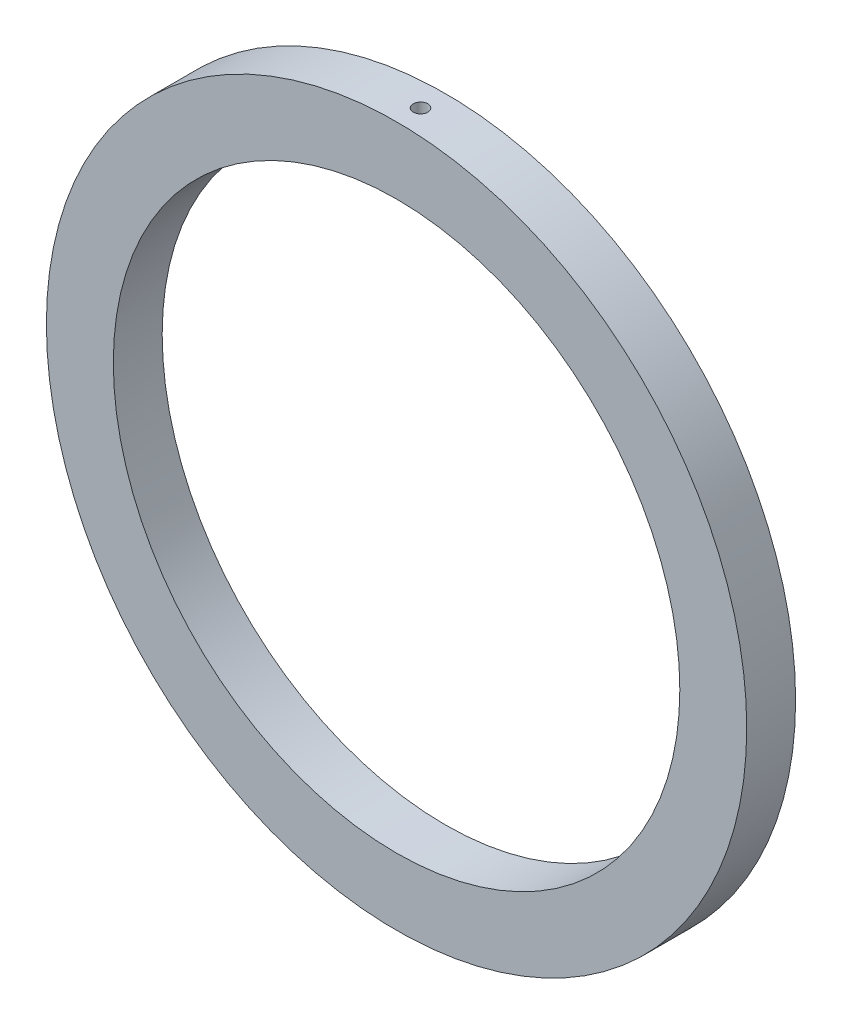
ISO-10303-21;
HEADER;
FILE_DESCRIPTION(('STEP AP214'),'2;1');
FILE_NAME('part.step','',(''),(''),'','','');
FILE_SCHEMA(('AUTOMOTIVE_DESIGN { 1 0 10303 214 1 1 1 1 }'));
ENDSEC;
DATA;
#1=APPLICATION_CONTEXT('core data for automotive mechanical design processes');
#2=APPLICATION_PROTOCOL_DEFINITION('international standard','automotive_design',2000,#1);
#3=PRODUCT_CONTEXT('',#1,'mechanical');
#4=PRODUCT('Part','Part','',(#3));
#5=PRODUCT_RELATED_PRODUCT_CATEGORY('part','',(#4));
#6=PRODUCT_DEFINITION_FORMATION('','',#4);
#7=PRODUCT_DEFINITION_CONTEXT('part definition',#1,'design');
#8=PRODUCT_DEFINITION('design','',#6,#7);
#9=PRODUCT_DEFINITION_SHAPE('','',#8);
#10=(LENGTH_UNIT() NAMED_UNIT(*) SI_UNIT(.MILLI.,.METRE.));
#11=(NAMED_UNIT(*) PLANE_ANGLE_UNIT() SI_UNIT($,.RADIAN.));
#12=(NAMED_UNIT(*) SI_UNIT($,.STERADIAN.) SOLID_ANGLE_UNIT());
#13=UNCERTAINTY_MEASURE_WITH_UNIT(LENGTH_MEASURE(1.E-05),#10,'distance_accuracy_value','');
#14=(GEOMETRIC_REPRESENTATION_CONTEXT(3) GLOBAL_UNCERTAINTY_ASSIGNED_CONTEXT((#13)) GLOBAL_UNIT_ASSIGNED_CONTEXT((#10,
#11,#12)) REPRESENTATION_CONTEXT('',''));
#15=CARTESIAN_POINT('',(0.,0.,0.));
#16=DIRECTION('',(0.,0.,1.));
#17=DIRECTION('',(1.,0.,0.));
#18=AXIS2_PLACEMENT_3D('',#15,#16,#17);
#19=CARTESIAN_POINT('',(0.,0.,-1.9939));
#20=DIRECTION('',(0.,0.,1.));
#21=DIRECTION('',(1.,0.,0.));
#22=AXIS2_PLACEMENT_3D('',#19,#20,#21);
#23=CYLINDRICAL_SURFACE('',#22,28.575);
#24=CARTESIAN_POINT('',(0.,28.575,0.637578096554717));
#25=CARTESIAN_POINT('',(0.0334528999908487,28.5749999161991,0.637576614259042));
#26=CARTESIAN_POINT('',(0.0669299639904624,28.5749406242775,0.63475037074814));
#27=CARTESIAN_POINT('',(0.132961848801411,28.5747097969714,0.623515293730455));
#28=CARTESIAN_POINT('',(0.165515514746734,28.5745381269837,0.615099765367812));
#29=CARTESIAN_POINT('',(0.228734428833565,28.574101987914,0.592926033408662));
#30=CARTESIAN_POINT('',(0.259400581216334,28.5738375636805,0.579170411509186));
#31=CARTESIAN_POINT('',(0.317979756216489,28.5732457559899,0.54671058644263));
#32=CARTESIAN_POINT('',(0.345893455054542,28.5729183880554,0.528007602918667));
#33=CARTESIAN_POINT('',(0.398192242681697,28.5722374562947,0.486177180929941));
#34=CARTESIAN_POINT('',(0.422576481922313,28.5718838861924,0.463048680334133));
#35=CARTESIAN_POINT('',(0.467117124456493,28.5711904560958,0.413025317546382));
#36=CARTESIAN_POINT('',(0.487273360590718,28.570850596644,0.386130306510862));
#37=CARTESIAN_POINT('',(0.522786087063194,28.5702228961807,0.329335597564676));
#38=CARTESIAN_POINT('',(0.538142229739271,28.5699350589377,0.299435682221337));
#39=CARTESIAN_POINT('',(0.563616533922403,28.5694438983801,0.237481497482183));
#40=CARTESIAN_POINT('',(0.57373471101576,28.569240574814,0.205427234497251));
#41=CARTESIAN_POINT('',(0.588444484796919,28.5689414011349,0.140079173328698));
#42=CARTESIAN_POINT('',(0.593036884815562,28.5688455354001,0.106785556046629));
#43=CARTESIAN_POINT('',(0.596567211636588,28.5687720391495,0.0398998184894518));
#44=CARTESIAN_POINT('',(0.59550515460464,28.5687944082958,0.00630769906801369));
#45=CARTESIAN_POINT('',(0.587757411822672,28.5689548447067,-0.0602160288091746));
#46=CARTESIAN_POINT('',(0.581072598895781,28.5690928940144,-0.0931477389682907));
#47=CARTESIAN_POINT('',(0.562270448749933,28.569469099415,-0.157421406933881));
#48=CARTESIAN_POINT('',(0.550153102787935,28.5697072556691,-0.188763362181737));
#49=CARTESIAN_POINT('',(0.520828855441891,28.5702568469183,-0.24897061327009));
#50=CARTESIAN_POINT('',(0.503621553703102,28.5705682876774,-0.277835714061033));
#51=CARTESIAN_POINT('',(0.464606155929852,28.5712293310835,-0.332267725321397));
#52=CARTESIAN_POINT('',(0.442798055781932,28.5715789337647,-0.357834632841954));
#53=CARTESIAN_POINT('',(0.395195170796264,28.5722769682631,-0.40494959773213));
#54=CARTESIAN_POINT('',(0.36939962771116,28.5726253998447,-0.426496889012981));
#55=CARTESIAN_POINT('',(0.314556783589352,28.5732817469318,-0.464955068560625));
#56=CARTESIAN_POINT('',(0.285509482082942,28.5735896624314,-0.481865956157703));
#57=CARTESIAN_POINT('',(0.224987262369017,28.5741302664852,-0.510571191990976));
#58=CARTESIAN_POINT('',(0.193512333151503,28.5743629546981,-0.522365517020465));
#59=CARTESIAN_POINT('',(0.129028518783557,28.5747268665664,-0.540502339896482));
#60=CARTESIAN_POINT('',(0.0960196356843895,28.5748580903574,-0.546844845033184));
#61=CARTESIAN_POINT('',(0.0294115841189962,28.5750042630136,-0.553897048674563));
#62=CARTESIAN_POINT('',(-0.00418747209922792,28.5750192337546,-0.554607806928717));
#63=CARTESIAN_POINT('',(-0.0710279466882617,28.5749312705178,-0.550379101186067));
#64=CARTESIAN_POINT('',(-0.104269365250668,28.5748283366032,-0.545439640216407));
#65=CARTESIAN_POINT('',(-0.169447998357077,28.5745161811143,-0.530051587887457));
#66=CARTESIAN_POINT('',(-0.20138532633598,28.5743069688059,-0.5196034767967));
#67=CARTESIAN_POINT('',(-0.263052658950643,28.5738058378134,-0.493495200374856));
#68=CARTESIAN_POINT('',(-0.292782661589836,28.5735139190544,-0.477835030329431));
#69=CARTESIAN_POINT('',(-0.349196287514604,28.572880219415,-0.441744444692552));
#70=CARTESIAN_POINT('',(-0.375879454111067,28.5725384310772,-0.421313315377685));
#71=CARTESIAN_POINT('',(-0.425437380694861,28.5718435441532,-0.376261828458401));
#72=CARTESIAN_POINT('',(-0.448312135193495,28.5714904455508,-0.351641464816549));
#73=CARTESIAN_POINT('',(-0.489607425323709,28.5708126835533,-0.298905863132508));
#74=CARTESIAN_POINT('',(-0.508027276993644,28.5704880245295,-0.270790089441663));
#75=CARTESIAN_POINT('',(-0.539885197918953,28.5699038138735,-0.211864538225366));
#76=CARTESIAN_POINT('',(-0.553323275318891,28.5696442621349,-0.181054765104359));
#77=CARTESIAN_POINT('',(-0.574834997785161,28.5692195602294,-0.117618379860635));
#78=CARTESIAN_POINT('',(-0.582909087833757,28.5690544022321,-0.084991918689007));
#79=CARTESIAN_POINT('',(-0.593465103780745,28.5688370863681,-0.0188461389478242));
#80=CARTESIAN_POINT('',(-0.595947026834988,28.5687849285589,0.0146731800758243));
#81=CARTESIAN_POINT('',(-0.595248192421256,28.5687994966654,0.0816462678878778));
#82=CARTESIAN_POINT('',(-0.592068518280755,28.5688661998374,0.115100047990754));
#83=CARTESIAN_POINT('',(-0.58013896595761,28.5691109223478,0.18099888189537));
#84=CARTESIAN_POINT('',(-0.571389076643459,28.5692889419086,0.213443933681132));
#85=CARTESIAN_POINT('',(-0.54856751438054,28.5697362268339,0.276404992911517));
#86=CARTESIAN_POINT('',(-0.534495745658243,28.5700054938403,0.306920965628539));
#87=CARTESIAN_POINT('',(-0.501430556537403,28.5706049045306,0.36515639346809));
#88=CARTESIAN_POINT('',(-0.482437322009913,28.5709350459152,0.392875954148961));
#89=CARTESIAN_POINT('',(-0.440066352783966,28.5716190356953,0.444735939745629));
#90=CARTESIAN_POINT('',(-0.416688245778047,28.5719728861023,0.468876060429152));
#91=CARTESIAN_POINT('',(-0.366204293031286,28.5726644762261,0.512895213220377));
#92=CARTESIAN_POINT('',(-0.339097523897462,28.5730022119242,0.53277318668908));
#93=CARTESIAN_POINT('',(-0.281918161074939,28.5736235810191,0.56770547112011));
#94=CARTESIAN_POINT('',(-0.251843916131714,28.5739071840332,0.582757076424397));
#95=CARTESIAN_POINT('',(-0.189618119027895,28.5743877273754,0.60758010635843));
#96=CARTESIAN_POINT('',(-0.157469102641933,28.5745847712783,0.617357844796473));
#97=CARTESIAN_POINT('',(-0.104263388774644,28.5748171731576,0.628756739634627));
#98=CARTESIAN_POINT('',(-0.0835522339716464,28.5748854368502,0.632060603674147));
#99=CARTESIAN_POINT('',(-0.041897212756486,28.5749768765127,0.636471746200562));
#100=CARTESIAN_POINT('',(-0.0209533463770151,28.575000052489,0.637579024996039));
#101=CARTESIAN_POINT('',(0.,28.575,0.637578096554717));
#102=B_SPLINE_CURVE_WITH_KNOTS('',3,(#24,#25,#26,#27,#28,#29,#30,#31,#32,#33,#34,#35,#36,#37,
#38,#39,#40,#41,#42,#43,#44,#45,#46,#47,#48,#49,#50,#51,#52,#53,#54,#55,#56,#57,#58,#59,#60,#61,
#62,#63,#64,#65,#66,#67,#68,#69,#70,#71,#72,#73,#74,#75,#76,#77,#78,#79,#80,#81,#82,#83,#84,#85,
#86,#87,#88,#89,#90,#91,#92,#93,#94,#95,#96,#97,#98,#99,#100,#101),.UNSPECIFIED.,.T.,.F.,(4,2,2,
2,2,2,2,2,2,2,2,2,2,2,2,2,2,2,2,2,2,2,2,2,2,2,2,2,2,2,2,2,2,2,2,2,2,2,4),(0.,0.100282218977829,
0.20068477333894,0.301038847871405,0.401368205740381,0.50172167308372,0.602079107278149,
0.702443808498554,0.802808211068008,0.903158021017436,1.00350754407442,1.10384149270037,
1.20417560280289,1.30451760686848,1.40485970064771,1.50522089888521,1.6055821116196,
1.70594377954805,1.80630531327267,1.90664796109713,2.00699055516234,2.10732440236174,
2.20765834031392,2.30800729759555,2.40835639949919,2.50872089824345,2.60908523290384,
2.70944124056332,2.80979729926334,2.91013415723452,3.01047121571933,3.1108100799744,
3.21114515524191,3.31148875354441,3.41185724655385,3.51228190808494,3.61258607408226,
3.67539821788629,3.73821035286631),.UNSPECIFIED.);
#103=CARTESIAN_POINT('',(0.,28.575,0.637578096554717));
#104=VERTEX_POINT('',#103);
#105=EDGE_CURVE('E11',#104,#104,#102,.T.);
#106=ORIENTED_EDGE('',*,*,#105,.F.);
#107=EDGE_LOOP('',(#106));
#108=FACE_BOUND('',#107,.T.);
#109=CARTESIAN_POINT('',(0.,0.,-1.9939));
#110=DIRECTION('',(0.,0.,1.));
#111=DIRECTION('',(1.,0.,0.));
#112=AXIS2_PLACEMENT_3D('',#109,#110,#111);
#113=CIRCLE('',#112,28.575);
#114=CARTESIAN_POINT('',(28.575,0.,-1.9939));
#115=VERTEX_POINT('',#114);
#116=EDGE_CURVE('E47',#115,#115,#113,.T.);
#117=ORIENTED_EDGE('',*,*,#116,.T.);
#118=EDGE_LOOP('',(#117));
#119=FACE_BOUND('',#118,.T.);
#120=CARTESIAN_POINT('',(0.,0.,1.9939));
#121=DIRECTION('',(0.,0.,1.));
#122=DIRECTION('',(1.,0.,0.));
#123=AXIS2_PLACEMENT_3D('',#120,#121,#122);
#124=CIRCLE('',#123,28.575);
#125=CARTESIAN_POINT('',(28.575,0.,1.9939));
#126=VERTEX_POINT('',#125);
#127=EDGE_CURVE('E63',#126,#126,#124,.T.);
#128=ORIENTED_EDGE('',*,*,#127,.F.);
#129=EDGE_LOOP('',(#128));
#130=FACE_BOUND('',#129,.T.);
#131=ADVANCED_FACE('F37',(#108,#119,#130),#23,.T.);
#132=CARTESIAN_POINT('',(0.,0.,-1.9939));
#133=DIRECTION('',(0.,0.,1.));
#134=DIRECTION('',(1.,0.,0.));
#135=AXIS2_PLACEMENT_3D('',#132,#133,#134);
#136=PLANE('',#135);
#137=CARTESIAN_POINT('',(0.,0.,-1.9939));
#138=DIRECTION('',(0.,0.,1.));
#139=DIRECTION('',(1.,0.,0.));
#140=AXIS2_PLACEMENT_3D('',#137,#138,#139);
#141=CIRCLE('',#140,23.114);
#142=CARTESIAN_POINT('',(23.114,0.,-1.9939));
#143=VERTEX_POINT('',#142);
#144=EDGE_CURVE('E68',#143,#143,#141,.T.);
#145=ORIENTED_EDGE('',*,*,#144,.T.);
#146=EDGE_LOOP('',(#145));
#147=FACE_BOUND('',#146,.T.);
#148=ORIENTED_EDGE('',*,*,#116,.F.);
#149=EDGE_LOOP('',(#148));
#150=FACE_BOUND('',#149,.T.);
#151=ADVANCED_FACE('F75',(#147,#150),#136,.F.);
#152=CARTESIAN_POINT('',(0.,0.,-1.9939));
#153=DIRECTION('',(0.,0.,1.));
#154=DIRECTION('',(1.,0.,0.));
#155=AXIS2_PLACEMENT_3D('',#152,#153,#154);
#156=CYLINDRICAL_SURFACE('',#155,23.114);
#157=ORIENTED_EDGE('',*,*,#144,.F.);
#158=EDGE_LOOP('',(#157));
#159=FACE_BOUND('',#158,.T.);
#160=CARTESIAN_POINT('',(0.,0.,1.9939));
#161=DIRECTION('',(0.,0.,1.));
#162=DIRECTION('',(1.,0.,0.));
#163=AXIS2_PLACEMENT_3D('',#160,#161,#162);
#164=CIRCLE('',#163,23.114);
#165=CARTESIAN_POINT('',(23.114,0.,1.9939));
#166=VERTEX_POINT('',#165);
#167=EDGE_CURVE('E60',#166,#166,#164,.T.);
#168=ORIENTED_EDGE('',*,*,#167,.T.);
#169=EDGE_LOOP('',(#168));
#170=FACE_BOUND('',#169,.T.);
#171=ADVANCED_FACE('F77',(#159,#170),#156,.F.);
#172=CARTESIAN_POINT('',(0.,0.,1.9939));
#173=DIRECTION('',(0.,0.,1.));
#174=DIRECTION('',(1.,0.,0.));
#175=AXIS2_PLACEMENT_3D('',#172,#173,#174);
#176=PLANE('',#175);
#177=ORIENTED_EDGE('',*,*,#127,.T.);
#178=EDGE_LOOP('',(#177));
#179=FACE_BOUND('',#178,.T.);
#180=ORIENTED_EDGE('',*,*,#167,.F.);
#181=EDGE_LOOP('',(#180));
#182=FACE_BOUND('',#181,.T.);
#183=ADVANCED_FACE('F54',(#179,#182),#176,.T.);
#184=CARTESIAN_POINT('',(0.,24.511,0.0419480965547281));
#185=DIRECTION('',(0.,1.,0.));
#186=DIRECTION('',(0.,0.,1.));
#187=AXIS2_PLACEMENT_3D('',#184,#185,#186);
#188=CONICAL_SURFACE('',#187,0.595629999999988,1.02974425867665);
#189=CARTESIAN_POINT('',(0.,24.1531093894886,0.0419480965547281));
#190=VERTEX_POINT('',#189);
#191=VERTEX_LOOP('',#190);
#192=FACE_BOUND('',#191,.T.);
#193=CARTESIAN_POINT('',(0.,24.511,0.0419480965547281));
#194=DIRECTION('',(0.,1.,0.));
#195=DIRECTION('',(0.,0.,1.));
#196=AXIS2_PLACEMENT_3D('',#193,#194,#195);
#197=CIRCLE('',#196,0.595629999999988);
#198=CARTESIAN_POINT('',(0.,24.511,0.637578096554716));
#199=VERTEX_POINT('',#198);
#200=EDGE_CURVE('E58',#199,#199,#197,.T.);
#201=ORIENTED_EDGE('',*,*,#200,.T.);
#202=EDGE_LOOP('',(#201));
#203=FACE_BOUND('',#202,.T.);
#204=ADVANCED_FACE('F50',(#192,#203),#188,.F.);
#205=CARTESIAN_POINT('',(0.,28.575,0.0419480965547281));
#206=DIRECTION('',(0.,1.,0.));
#207=DIRECTION('',(0.,0.,1.));
#208=AXIS2_PLACEMENT_3D('',#205,#206,#207);
#209=CYLINDRICAL_SURFACE('',#208,0.595629999999988);
#210=ORIENTED_EDGE('',*,*,#105,.T.);
#211=EDGE_LOOP('',(#210));
#212=FACE_BOUND('',#211,.T.);
#213=ORIENTED_EDGE('',*,*,#200,.F.);
#214=EDGE_LOOP('',(#213));
#215=FACE_BOUND('',#214,.T.);
#216=ADVANCED_FACE('F53',(#212,#215),#209,.F.);
#217=CLOSED_SHELL('',(#131,#151,#171,#183,#204,#216));
#218=MANIFOLD_SOLID_BREP('B2',#217);
#219=ADVANCED_BREP_SHAPE_REPRESENTATION('',(#18,#218),#14);
#220=SHAPE_DEFINITION_REPRESENTATION(#9,#219);
ENDSEC;
END-ISO-10303-21;
